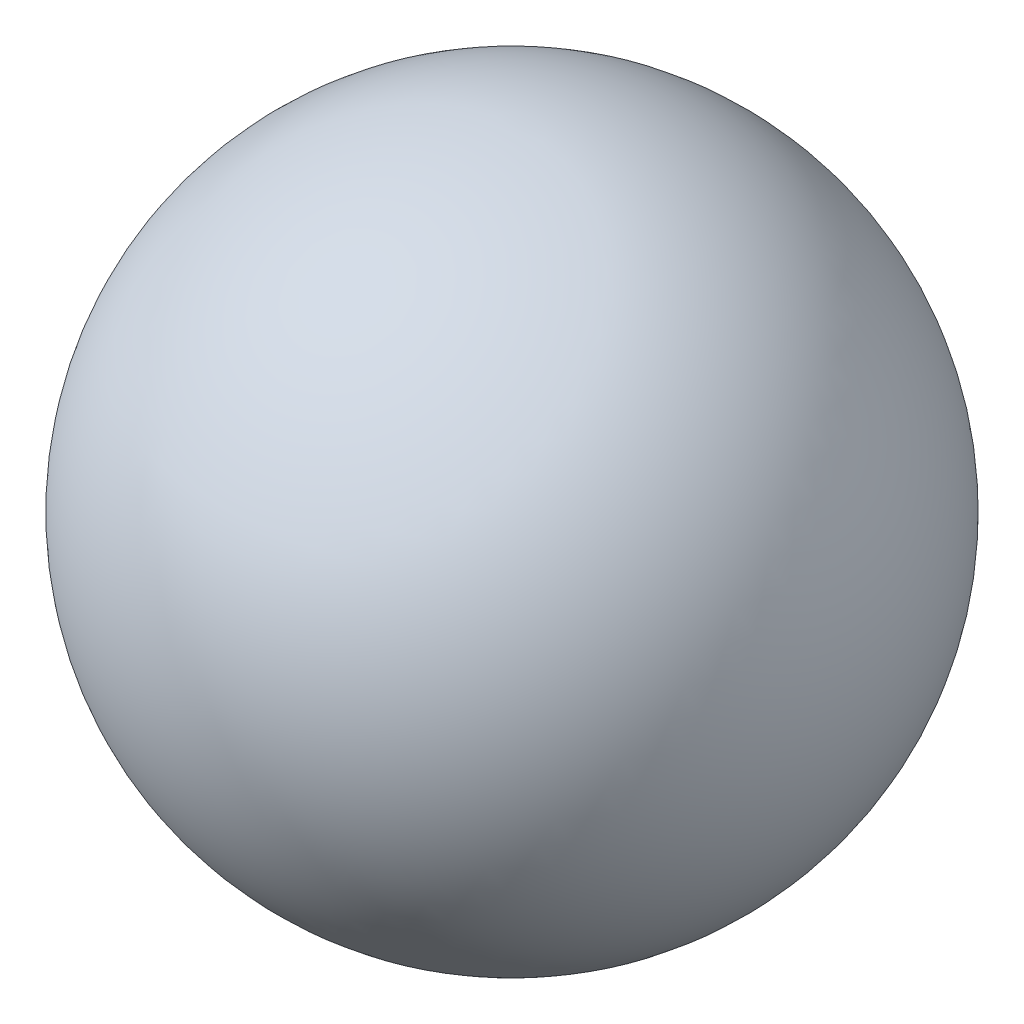
ISO-10303-21;
HEADER;
FILE_DESCRIPTION(('STEP AP214'),'2;1');
FILE_NAME('part.step','',(''),(''),'','','');
FILE_SCHEMA(('AUTOMOTIVE_DESIGN { 1 0 10303 214 1 1 1 1 }'));
ENDSEC;
DATA;
#1=APPLICATION_CONTEXT('core data for automotive mechanical design processes');
#2=APPLICATION_PROTOCOL_DEFINITION('international standard','automotive_design',2000,#1);
#3=PRODUCT_CONTEXT('',#1,'mechanical');
#4=PRODUCT('Part','Part','',(#3));
#5=PRODUCT_RELATED_PRODUCT_CATEGORY('part','',(#4));
#6=PRODUCT_DEFINITION_FORMATION('','',#4);
#7=PRODUCT_DEFINITION_CONTEXT('part definition',#1,'design');
#8=PRODUCT_DEFINITION('design','',#6,#7);
#9=PRODUCT_DEFINITION_SHAPE('','',#8);
#10=(LENGTH_UNIT() NAMED_UNIT(*) SI_UNIT(.MILLI.,.METRE.));
#11=(NAMED_UNIT(*) PLANE_ANGLE_UNIT() SI_UNIT($,.RADIAN.));
#12=(NAMED_UNIT(*) SI_UNIT($,.STERADIAN.) SOLID_ANGLE_UNIT());
#13=UNCERTAINTY_MEASURE_WITH_UNIT(LENGTH_MEASURE(1.E-05),#10,'distance_accuracy_value','');
#14=(GEOMETRIC_REPRESENTATION_CONTEXT(3) GLOBAL_UNCERTAINTY_ASSIGNED_CONTEXT((#13)) GLOBAL_UNIT_ASSIGNED_CONTEXT((#10,
#11,#12)) REPRESENTATION_CONTEXT('',''));
#15=CARTESIAN_POINT('',(0.,0.,0.));
#16=DIRECTION('',(0.,0.,1.));
#17=DIRECTION('',(1.,0.,0.));
#18=AXIS2_PLACEMENT_3D('',#15,#16,#17);
#19=CARTESIAN_POINT('',(0.,300.,0.));
#20=DIRECTION('',(0.,-1.,0.));
#21=DIRECTION('',(-1.,0.,0.));
#22=AXIS2_PLACEMENT_3D('',#19,#20,#21);
#23=SPHERICAL_SURFACE('',#22,300.);
#24=CARTESIAN_POINT('',(0.,0.,0.));
#25=VERTEX_POINT('',#24);
#26=VERTEX_LOOP('',#25);
#27=FACE_BOUND('',#26,.T.);
#28=ADVANCED_FACE('F31',(#27),#23,.T.);
#29=CLOSED_SHELL('',(#28));
#30=CARTESIAN_POINT('',(0.,300.,0.));
#31=DIRECTION('',(0.,-1.,0.));
#32=DIRECTION('',(-1.,0.,0.));
#33=AXIS2_PLACEMENT_3D('',#30,#31,#32);
#34=SPHERICAL_SURFACE('',#33,299.97);
#35=CARTESIAN_POINT('',(0.,0.0299999999999745,0.));
#36=VERTEX_POINT('',#35);
#37=VERTEX_LOOP('',#36);
#38=FACE_BOUND('',#37,.T.);
#39=ADVANCED_FACE('F33',(#38),#34,.F.);
#40=CLOSED_SHELL('',(#39));
#41=ORIENTED_CLOSED_SHELL('',*,#40,.T.);
#42=BREP_WITH_VOIDS('B2',#29,(#41));
#43=ADVANCED_BREP_SHAPE_REPRESENTATION('',(#18,#42),#14);
#44=SHAPE_DEFINITION_REPRESENTATION(#9,#43);
ENDSEC;
END-ISO-10303-21;
